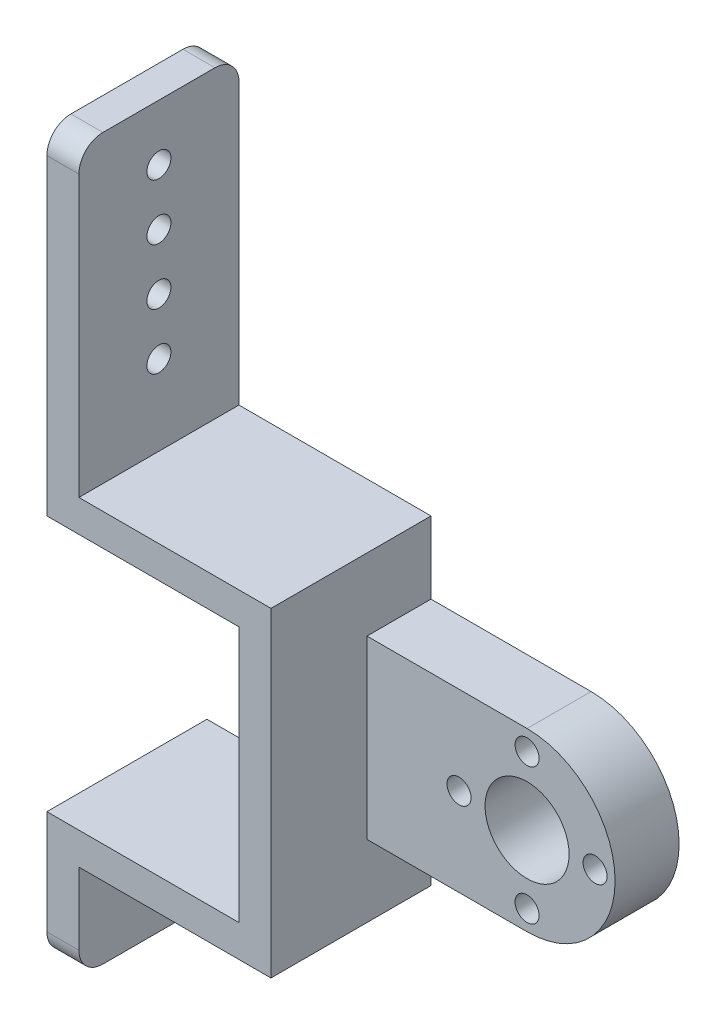
ISO-10303-21;
HEADER;
FILE_DESCRIPTION(('STEP AP214'),'2;1');
FILE_NAME('part.step','',(''),(''),'','','');
FILE_SCHEMA(('AUTOMOTIVE_DESIGN { 1 0 10303 214 1 1 1 1 }'));
ENDSEC;
DATA;
#1=APPLICATION_CONTEXT('core data for automotive mechanical design processes');
#2=APPLICATION_PROTOCOL_DEFINITION('international standard','automotive_design',2000,#1);
#3=PRODUCT_CONTEXT('',#1,'mechanical');
#4=PRODUCT('Part','Part','',(#3));
#5=PRODUCT_RELATED_PRODUCT_CATEGORY('part','',(#4));
#6=PRODUCT_DEFINITION_FORMATION('','',#4);
#7=PRODUCT_DEFINITION_CONTEXT('part definition',#1,'design');
#8=PRODUCT_DEFINITION('design','',#6,#7);
#9=PRODUCT_DEFINITION_SHAPE('','',#8);
#10=(LENGTH_UNIT() NAMED_UNIT(*) SI_UNIT(.MILLI.,.METRE.));
#11=(NAMED_UNIT(*) PLANE_ANGLE_UNIT() SI_UNIT($,.RADIAN.));
#12=(NAMED_UNIT(*) SI_UNIT($,.STERADIAN.) SOLID_ANGLE_UNIT());
#13=UNCERTAINTY_MEASURE_WITH_UNIT(LENGTH_MEASURE(1.E-05),#10,'distance_accuracy_value','');
#14=(GEOMETRIC_REPRESENTATION_CONTEXT(3) GLOBAL_UNCERTAINTY_ASSIGNED_CONTEXT((#13)) GLOBAL_UNIT_ASSIGNED_CONTEXT((#10,
#11,#12)) REPRESENTATION_CONTEXT('',''));
#15=CARTESIAN_POINT('',(0.,0.,0.));
#16=DIRECTION('',(0.,0.,1.));
#17=DIRECTION('',(1.,0.,0.));
#18=AXIS2_PLACEMENT_3D('',#15,#16,#17);
#19=CARTESIAN_POINT('',(-8.,20.,0.));
#20=DIRECTION('',(1.,0.,0.));
#21=DIRECTION('',(0.,0.,-1.));
#22=AXIS2_PLACEMENT_3D('',#19,#20,#21);
#23=PLANE('',#22);
#24=DIRECTION('',(0.,1.,0.));
#25=VECTOR('',#24,1.);
#26=CARTESIAN_POINT('',(-8.,20.,8.));
#27=LINE('',#26,#25);
#28=CARTESIAN_POINT('',(-7.99999999999999,-20.,8.));
#29=VERTEX_POINT('',#28);
#30=CARTESIAN_POINT('',(-8.,20.,8.));
#31=VERTEX_POINT('',#30);
#32=EDGE_CURVE('E357',#29,#31,#27,.T.);
#33=ORIENTED_EDGE('',*,*,#32,.F.);
#34=DIRECTION('',(0.,0.,1.));
#35=VECTOR('',#34,1.);
#36=CARTESIAN_POINT('',(-7.99999999999999,-20.,0.));
#37=LINE('',#36,#35);
#38=CARTESIAN_POINT('',(-8.,-20.,-12.));
#39=VERTEX_POINT('',#38);
#40=EDGE_CURVE('E349',#39,#29,#37,.T.);
#41=ORIENTED_EDGE('',*,*,#40,.F.);
#42=DIRECTION('',(0.,-1.,0.));
#43=VECTOR('',#42,1.);
#44=CARTESIAN_POINT('',(-8.,20.,-12.));
#45=LINE('',#44,#43);
#46=CARTESIAN_POINT('',(-8.,-11.,-12.));
#47=VERTEX_POINT('',#46);
#48=EDGE_CURVE('E336',#47,#39,#45,.T.);
#49=ORIENTED_EDGE('',*,*,#48,.F.);
#50=DIRECTION('',(0.,0.,-1.));
#51=VECTOR('',#50,1.);
#52=CARTESIAN_POINT('',(-8.,-11.,-12.));
#53=LINE('',#52,#51);
#54=CARTESIAN_POINT('',(-8.,-11.,-4.));
#55=VERTEX_POINT('',#54);
#56=EDGE_CURVE('E204',#55,#47,#53,.T.);
#57=ORIENTED_EDGE('',*,*,#56,.F.);
#58=DIRECTION('',(0.,-1.,0.));
#59=VECTOR('',#58,1.);
#60=CARTESIAN_POINT('',(-8.,11.,-4.));
#61=LINE('',#60,#59);
#62=CARTESIAN_POINT('',(-8.,11.,-4.));
#63=VERTEX_POINT('',#62);
#64=EDGE_CURVE('E224',#63,#55,#61,.T.);
#65=ORIENTED_EDGE('',*,*,#64,.F.);
#66=DIRECTION('',(0.,0.,1.));
#67=VECTOR('',#66,1.);
#68=CARTESIAN_POINT('',(-8.,11.,-12.));
#69=LINE('',#68,#67);
#70=CARTESIAN_POINT('',(-8.,11.,-12.));
#71=VERTEX_POINT('',#70);
#72=EDGE_CURVE('E214',#71,#63,#69,.T.);
#73=ORIENTED_EDGE('',*,*,#72,.F.);
#74=CARTESIAN_POINT('',(-8.,20.,-12.));
#75=VERTEX_POINT('',#74);
#76=EDGE_CURVE('E188',#75,#71,#45,.T.);
#77=ORIENTED_EDGE('',*,*,#76,.F.);
#78=DIRECTION('',(0.,0.,1.));
#79=VECTOR('',#78,1.);
#80=CARTESIAN_POINT('',(-8.,20.,0.));
#81=LINE('',#80,#79);
#82=EDGE_CURVE('E365',#75,#31,#81,.T.);
#83=ORIENTED_EDGE('',*,*,#82,.T.);
#84=EDGE_LOOP('',(#33,#41,#49,#57,#65,#73,#77,#83));
#85=FACE_BOUND('',#84,.T.);
#86=ADVANCED_FACE('F43',(#85),#23,.T.);
#87=CARTESIAN_POINT('',(-12.,0.,8.));
#88=DIRECTION('',(-1.,0.,0.));
#89=DIRECTION('',(0.,0.,1.));
#90=AXIS2_PLACEMENT_3D('',#87,#88,#89);
#91=PLANE('',#90);
#92=DIRECTION('',(0.,1.,0.));
#93=VECTOR('',#92,1.);
#94=CARTESIAN_POINT('',(-12.,20.,-12.));
#95=LINE('',#94,#93);
#96=CARTESIAN_POINT('',(-12.,-16.,-12.));
#97=VERTEX_POINT('',#96);
#98=CARTESIAN_POINT('',(-12.,16.,-12.));
#99=VERTEX_POINT('',#98);
#100=EDGE_CURVE('E343',#97,#99,#95,.T.);
#101=ORIENTED_EDGE('',*,*,#100,.F.);
#102=DIRECTION('',(0.,0.,-1.));
#103=VECTOR('',#102,1.);
#104=CARTESIAN_POINT('',(-12.,-16.,-12.));
#105=LINE('',#104,#103);
#106=CARTESIAN_POINT('',(-12.,-16.,8.));
#107=VERTEX_POINT('',#106);
#108=EDGE_CURVE('E287',#107,#97,#105,.T.);
#109=ORIENTED_EDGE('',*,*,#108,.F.);
#110=DIRECTION('',(0.,1.,0.));
#111=VECTOR('',#110,1.);
#112=CARTESIAN_POINT('',(-12.,0.,8.));
#113=LINE('',#112,#111);
#114=CARTESIAN_POINT('',(-12.,16.,8.));
#115=VERTEX_POINT('',#114);
#116=EDGE_CURVE('E368',#107,#115,#113,.T.);
#117=ORIENTED_EDGE('',*,*,#116,.T.);
#118=DIRECTION('',(0.,0.,1.));
#119=VECTOR('',#118,1.);
#120=CARTESIAN_POINT('',(-12.,16.,-12.));
#121=LINE('',#120,#119);
#122=EDGE_CURVE('E314',#99,#115,#121,.T.);
#123=ORIENTED_EDGE('',*,*,#122,.F.);
#124=EDGE_LOOP('',(#101,#109,#117,#123));
#125=FACE_BOUND('',#124,.T.);
#126=ADVANCED_FACE('F472',(#125),#91,.T.);
#127=CARTESIAN_POINT('',(0.,0.,8.));
#128=DIRECTION('',(0.,0.,1.));
#129=DIRECTION('',(1.,0.,0.));
#130=AXIS2_PLACEMENT_3D('',#127,#128,#129);
#131=PLANE('',#130);
#132=DIRECTION('',(1.,0.,0.));
#133=VECTOR('',#132,1.);
#134=CARTESIAN_POINT('',(-12.,-20.,8.));
#135=LINE('',#134,#133);
#136=CARTESIAN_POINT('',(-32.,-20.,8.));
#137=VERTEX_POINT('',#136);
#138=EDGE_CURVE('E353',#137,#29,#135,.T.);
#139=ORIENTED_EDGE('',*,*,#138,.T.);
#140=ORIENTED_EDGE('',*,*,#32,.T.);
#141=DIRECTION('',(-1.,0.,0.));
#142=VECTOR('',#141,1.);
#143=CARTESIAN_POINT('',(-12.,20.,8.));
#144=LINE('',#143,#142);
#145=CARTESIAN_POINT('',(-32.,20.,8.));
#146=VERTEX_POINT('',#145);
#147=EDGE_CURVE('E361',#31,#146,#144,.T.);
#148=ORIENTED_EDGE('',*,*,#147,.T.);
#149=DIRECTION('',(0.,-1.,0.));
#150=VECTOR('',#149,1.);
#151=CARTESIAN_POINT('',(-32.,20.,8.));
#152=LINE('',#151,#150);
#153=CARTESIAN_POINT('',(-32.,55.,8.));
#154=VERTEX_POINT('',#153);
#155=EDGE_CURVE('E277',#154,#146,#152,.T.);
#156=ORIENTED_EDGE('',*,*,#155,.F.);
#157=DIRECTION('',(1.,0.,0.));
#158=VECTOR('',#157,1.);
#159=CARTESIAN_POINT('',(0.,55.,8.));
#160=LINE('',#159,#158);
#161=CARTESIAN_POINT('',(-36.,55.,8.));
#162=VERTEX_POINT('',#161);
#163=EDGE_CURVE('E404',#154,#162,#160,.F.);
#164=ORIENTED_EDGE('',*,*,#163,.T.);
#165=DIRECTION('',(0.,1.,0.));
#166=VECTOR('',#165,1.);
#167=CARTESIAN_POINT('',(-36.,20.,8.));
#168=LINE('',#167,#166);
#169=CARTESIAN_POINT('',(-36.,16.,8.));
#170=VERTEX_POINT('',#169);
#171=EDGE_CURVE('E321',#170,#162,#168,.T.);
#172=ORIENTED_EDGE('',*,*,#171,.F.);
#173=DIRECTION('',(1.,0.,0.));
#174=VECTOR('',#173,1.);
#175=CARTESIAN_POINT('',(-36.,16.,8.));
#176=LINE('',#175,#174);
#177=EDGE_CURVE('E325',#170,#115,#176,.T.);
#178=ORIENTED_EDGE('',*,*,#177,.T.);
#179=ORIENTED_EDGE('',*,*,#116,.F.);
#180=DIRECTION('',(1.,0.,0.));
#181=VECTOR('',#180,1.);
#182=CARTESIAN_POINT('',(-36.,-16.,8.));
#183=LINE('',#182,#181);
#184=CARTESIAN_POINT('',(-36.,-16.,8.));
#185=VERTEX_POINT('',#184);
#186=EDGE_CURVE('E311',#185,#107,#183,.T.);
#187=ORIENTED_EDGE('',*,*,#186,.F.);
#188=DIRECTION('',(0.,1.,0.));
#189=VECTOR('',#188,1.);
#190=CARTESIAN_POINT('',(-36.,-20.,8.));
#191=LINE('',#190,#189);
#192=CARTESIAN_POINT('',(-36.,-29.,8.));
#193=VERTEX_POINT('',#192);
#194=EDGE_CURVE('E299',#193,#185,#191,.T.);
#195=ORIENTED_EDGE('',*,*,#194,.F.);
#196=DIRECTION('',(-1.,0.,0.));
#197=VECTOR('',#196,1.);
#198=CARTESIAN_POINT('',(0.,-29.,8.));
#199=LINE('',#198,#197);
#200=CARTESIAN_POINT('',(-32.,-29.,8.));
#201=VERTEX_POINT('',#200);
#202=EDGE_CURVE('E401',#193,#201,#199,.F.);
#203=ORIENTED_EDGE('',*,*,#202,.T.);
#204=DIRECTION('',(0.,1.,0.));
#205=VECTOR('',#204,1.);
#206=CARTESIAN_POINT('',(-32.,-32.,8.));
#207=LINE('',#206,#205);
#208=EDGE_CURVE('E267',#201,#137,#207,.T.);
#209=ORIENTED_EDGE('',*,*,#208,.T.);
#210=EDGE_LOOP('',(#139,#140,#148,#156,#164,#172,#178,#179,#187,#195,#203,#209));
#211=FACE_BOUND('',#210,.T.);
#212=ADVANCED_FACE('F480',(#211),#131,.T.);
#213=CARTESIAN_POINT('',(-12.,20.,0.));
#214=DIRECTION('',(0.,1.,0.));
#215=DIRECTION('',(0.,0.,1.));
#216=AXIS2_PLACEMENT_3D('',#213,#214,#215);
#217=PLANE('',#216);
#218=DIRECTION('',(0.,0.,-1.));
#219=VECTOR('',#218,1.);
#220=CARTESIAN_POINT('',(-32.,20.,8.));
#221=LINE('',#220,#219);
#222=CARTESIAN_POINT('',(-32.,20.,-12.));
#223=VERTEX_POINT('',#222);
#224=EDGE_CURVE('E288',#146,#223,#221,.T.);
#225=ORIENTED_EDGE('',*,*,#224,.F.);
#226=ORIENTED_EDGE('',*,*,#147,.F.);
#227=ORIENTED_EDGE('',*,*,#82,.F.);
#228=DIRECTION('',(1.,0.,0.));
#229=VECTOR('',#228,1.);
#230=CARTESIAN_POINT('',(-8.,20.,-12.));
#231=LINE('',#230,#229);
#232=EDGE_CURVE('E346',#223,#75,#231,.T.);
#233=ORIENTED_EDGE('',*,*,#232,.F.);
#234=EDGE_LOOP('',(#225,#226,#227,#233));
#235=FACE_BOUND('',#234,.T.);
#236=ADVANCED_FACE('F485',(#235),#217,.T.);
#237=CARTESIAN_POINT('',(-12.,-20.,0.));
#238=DIRECTION('',(0.,-1.,0.));
#239=DIRECTION('',(0.,0.,-1.));
#240=AXIS2_PLACEMENT_3D('',#237,#238,#239);
#241=PLANE('',#240);
#242=DIRECTION('',(0.,0.,1.));
#243=VECTOR('',#242,1.);
#244=CARTESIAN_POINT('',(-32.,-20.,8.));
#245=LINE('',#244,#243);
#246=CARTESIAN_POINT('',(-32.,-20.,-12.));
#247=VERTEX_POINT('',#246);
#248=EDGE_CURVE('E264',#247,#137,#245,.T.);
#249=ORIENTED_EDGE('',*,*,#248,.F.);
#250=DIRECTION('',(-1.,0.,0.));
#251=VECTOR('',#250,1.);
#252=CARTESIAN_POINT('',(-8.,-20.,-12.));
#253=LINE('',#252,#251);
#254=EDGE_CURVE('E339',#39,#247,#253,.T.);
#255=ORIENTED_EDGE('',*,*,#254,.F.);
#256=ORIENTED_EDGE('',*,*,#40,.T.);
#257=ORIENTED_EDGE('',*,*,#138,.F.);
#258=EDGE_LOOP('',(#249,#255,#256,#257));
#259=FACE_BOUND('',#258,.T.);
#260=ADVANCED_FACE('F530',(#259),#241,.T.);
#261=CARTESIAN_POINT('',(0.,0.,-12.));
#262=DIRECTION('',(0.,0.,-1.));
#263=DIRECTION('',(-1.,0.,0.));
#264=AXIS2_PLACEMENT_3D('',#261,#262,#263);
#265=PLANE('',#264);
#266=CARTESIAN_POINT('',(12.,8.5,-12.));
#267=DIRECTION('',(0.,0.,1.));
#268=DIRECTION('',(1.,0.,0.));
#269=AXIS2_PLACEMENT_3D('',#266,#267,#268);
#270=CIRCLE('',#269,1.5);
#271=CARTESIAN_POINT('',(13.5,8.5,-12.));
#272=VERTEX_POINT('',#271);
#273=EDGE_CURVE('E440',#272,#272,#270,.T.);
#274=ORIENTED_EDGE('',*,*,#273,.T.);
#275=EDGE_LOOP('',(#274));
#276=FACE_BOUND('',#275,.T.);
#277=CARTESIAN_POINT('',(12.,0.,-12.));
#278=DIRECTION('',(0.,0.,1.));
#279=DIRECTION('',(1.,0.,0.));
#280=AXIS2_PLACEMENT_3D('',#277,#278,#279);
#281=CIRCLE('',#280,5.25);
#282=CARTESIAN_POINT('',(17.25,0.,-12.));
#283=VERTEX_POINT('',#282);
#284=EDGE_CURVE('E972',#283,#283,#281,.T.);
#285=ORIENTED_EDGE('',*,*,#284,.T.);
#286=EDGE_LOOP('',(#285));
#287=FACE_BOUND('',#286,.T.);
#288=CARTESIAN_POINT('',(12.,-8.5,-12.));
#289=DIRECTION('',(0.,0.,1.));
#290=DIRECTION('',(1.,0.,0.));
#291=AXIS2_PLACEMENT_3D('',#288,#289,#290);
#292=CIRCLE('',#291,1.5);
#293=CARTESIAN_POINT('',(13.5,-8.5,-12.));
#294=VERTEX_POINT('',#293);
#295=EDGE_CURVE('E966',#294,#294,#292,.T.);
#296=ORIENTED_EDGE('',*,*,#295,.T.);
#297=EDGE_LOOP('',(#296));
#298=FACE_BOUND('',#297,.T.);
#299=CARTESIAN_POINT('',(3.5,0.,-12.));
#300=DIRECTION('',(0.,0.,1.));
#301=DIRECTION('',(1.,0.,0.));
#302=AXIS2_PLACEMENT_3D('',#299,#300,#301);
#303=CIRCLE('',#302,1.5);
#304=CARTESIAN_POINT('',(5.,0.,-12.));
#305=VERTEX_POINT('',#304);
#306=EDGE_CURVE('E953',#305,#305,#303,.T.);
#307=ORIENTED_EDGE('',*,*,#306,.T.);
#308=EDGE_LOOP('',(#307));
#309=FACE_BOUND('',#308,.T.);
#310=CARTESIAN_POINT('',(20.5,0.,-12.));
#311=DIRECTION('',(0.,0.,1.));
#312=DIRECTION('',(1.,0.,0.));
#313=AXIS2_PLACEMENT_3D('',#310,#311,#312);
#314=CIRCLE('',#313,1.5);
#315=CARTESIAN_POINT('',(22.,0.,-12.));
#316=VERTEX_POINT('',#315);
#317=EDGE_CURVE('E965',#316,#316,#314,.T.);
#318=ORIENTED_EDGE('',*,*,#317,.T.);
#319=EDGE_LOOP('',(#318));
#320=FACE_BOUND('',#319,.T.);
#321=DIRECTION('',(-1.,0.,0.));
#322=VECTOR('',#321,1.);
#323=CARTESIAN_POINT('',(12.,11.,-12.));
#324=LINE('',#323,#322);
#325=CARTESIAN_POINT('',(12.,11.,-12.));
#326=VERTEX_POINT('',#325);
#327=EDGE_CURVE('E182',#326,#71,#324,.T.);
#328=ORIENTED_EDGE('',*,*,#327,.F.);
#329=CARTESIAN_POINT('',(12.,0.,-12.));
#330=DIRECTION('',(0.,0.,-1.));
#331=DIRECTION('',(-1.,0.,0.));
#332=AXIS2_PLACEMENT_3D('',#329,#330,#331);
#333=CIRCLE('',#332,11.);
#334=CARTESIAN_POINT('',(12.,-11.,-12.));
#335=VERTEX_POINT('',#334);
#336=EDGE_CURVE('E186',#326,#335,#333,.T.);
#337=ORIENTED_EDGE('',*,*,#336,.T.);
#338=DIRECTION('',(-1.,0.,0.));
#339=VECTOR('',#338,1.);
#340=CARTESIAN_POINT('',(12.,-11.,-12.));
#341=LINE('',#340,#339);
#342=EDGE_CURVE('E61',#335,#47,#341,.T.);
#343=ORIENTED_EDGE('',*,*,#342,.T.);
#344=ORIENTED_EDGE('',*,*,#48,.T.);
#345=ORIENTED_EDGE('',*,*,#254,.T.);
#346=DIRECTION('',(0.,1.,0.));
#347=VECTOR('',#346,1.);
#348=CARTESIAN_POINT('',(-32.,-32.,-12.));
#349=LINE('',#348,#347);
#350=CARTESIAN_POINT('',(-32.,-29.,-12.));
#351=VERTEX_POINT('',#350);
#352=EDGE_CURVE('E273',#351,#247,#349,.T.);
#353=ORIENTED_EDGE('',*,*,#352,.F.);
#354=DIRECTION('',(1.,0.,0.));
#355=VECTOR('',#354,1.);
#356=CARTESIAN_POINT('',(0.,-29.,-12.));
#357=LINE('',#356,#355);
#358=CARTESIAN_POINT('',(-36.,-29.,-12.));
#359=VERTEX_POINT('',#358);
#360=EDGE_CURVE('E413',#351,#359,#357,.F.);
#361=ORIENTED_EDGE('',*,*,#360,.T.);
#362=DIRECTION('',(0.,-1.,0.));
#363=VECTOR('',#362,1.);
#364=CARTESIAN_POINT('',(-36.,-20.,-12.));
#365=LINE('',#364,#363);
#366=CARTESIAN_POINT('',(-36.,-16.,-12.));
#367=VERTEX_POINT('',#366);
#368=EDGE_CURVE('E295',#367,#359,#365,.T.);
#369=ORIENTED_EDGE('',*,*,#368,.F.);
#370=DIRECTION('',(1.,0.,0.));
#371=VECTOR('',#370,1.);
#372=CARTESIAN_POINT('',(-36.,-16.,-12.));
#373=LINE('',#372,#371);
#374=EDGE_CURVE('E305',#367,#97,#373,.T.);
#375=ORIENTED_EDGE('',*,*,#374,.T.);
#376=ORIENTED_EDGE('',*,*,#100,.T.);
#377=DIRECTION('',(1.,0.,0.));
#378=VECTOR('',#377,1.);
#379=CARTESIAN_POINT('',(-36.,16.,-12.));
#380=LINE('',#379,#378);
#381=CARTESIAN_POINT('',(-36.,16.,-12.));
#382=VERTEX_POINT('',#381);
#383=EDGE_CURVE('E332',#382,#99,#380,.T.);
#384=ORIENTED_EDGE('',*,*,#383,.F.);
#385=DIRECTION('',(0.,-1.,0.));
#386=VECTOR('',#385,1.);
#387=CARTESIAN_POINT('',(-36.,20.,-12.));
#388=LINE('',#387,#386);
#389=CARTESIAN_POINT('',(-36.,55.,-12.));
#390=VERTEX_POINT('',#389);
#391=EDGE_CURVE('E315',#390,#382,#388,.T.);
#392=ORIENTED_EDGE('',*,*,#391,.F.);
#393=DIRECTION('',(1.,0.,0.));
#394=VECTOR('',#393,1.);
#395=CARTESIAN_POINT('',(0.,55.,-12.));
#396=LINE('',#395,#394);
#397=CARTESIAN_POINT('',(-32.,55.,-12.));
#398=VERTEX_POINT('',#397);
#399=EDGE_CURVE('E416',#390,#398,#396,.T.);
#400=ORIENTED_EDGE('',*,*,#399,.T.);
#401=DIRECTION('',(0.,-1.,0.));
#402=VECTOR('',#401,1.);
#403=CARTESIAN_POINT('',(-32.,20.,-12.));
#404=LINE('',#403,#402);
#405=EDGE_CURVE('E276',#398,#223,#404,.T.);
#406=ORIENTED_EDGE('',*,*,#405,.T.);
#407=ORIENTED_EDGE('',*,*,#232,.T.);
#408=ORIENTED_EDGE('',*,*,#76,.T.);
#409=EDGE_LOOP('',(#328,#337,#343,#344,#345,#353,#361,#369,#375,#376,#384,#392,#400,#406,#407,#408));
#410=FACE_BOUND('',#409,.T.);
#411=ADVANCED_FACE('F184',(#276,#287,#298,#309,#320,#410),#265,.T.);
#412=CARTESIAN_POINT('',(-36.,16.,-12.));
#413=DIRECTION('',(0.,1.,0.));
#414=DIRECTION('',(0.,0.,1.));
#415=AXIS2_PLACEMENT_3D('',#412,#413,#414);
#416=PLANE('',#415);
#417=ORIENTED_EDGE('',*,*,#122,.T.);
#418=ORIENTED_EDGE('',*,*,#177,.F.);
#419=DIRECTION('',(0.,0.,1.));
#420=VECTOR('',#419,1.);
#421=CARTESIAN_POINT('',(-36.,16.,-12.));
#422=LINE('',#421,#420);
#423=EDGE_CURVE('E318',#382,#170,#422,.T.);
#424=ORIENTED_EDGE('',*,*,#423,.F.);
#425=ORIENTED_EDGE('',*,*,#383,.T.);
#426=EDGE_LOOP('',(#417,#418,#424,#425));
#427=FACE_BOUND('',#426,.T.);
#428=ADVANCED_FACE('F560',(#427),#416,.F.);
#429=CARTESIAN_POINT('',(-36.,0.,0.));
#430=DIRECTION('',(-1.,0.,0.));
#431=DIRECTION('',(0.,0.,1.));
#432=AXIS2_PLACEMENT_3D('',#429,#430,#431);
#433=PLANE('',#432);
#434=CARTESIAN_POINT('',(-36.,51.,-2.));
#435=DIRECTION('',(-1.,0.,0.));
#436=DIRECTION('',(0.,0.,1.));
#437=AXIS2_PLACEMENT_3D('',#434,#435,#436);
#438=CIRCLE('',#437,1.5);
#439=CARTESIAN_POINT('',(-36.,51.,-0.499999999999999));
#440=VERTEX_POINT('',#439);
#441=EDGE_CURVE('E237',#440,#440,#438,.T.);
#442=ORIENTED_EDGE('',*,*,#441,.F.);
#443=EDGE_LOOP('',(#442));
#444=FACE_BOUND('',#443,.T.);
#445=CARTESIAN_POINT('',(-36.,44.,-2.));
#446=DIRECTION('',(-1.,0.,0.));
#447=DIRECTION('',(0.,0.,1.));
#448=AXIS2_PLACEMENT_3D('',#445,#446,#447);
#449=CIRCLE('',#448,1.5);
#450=CARTESIAN_POINT('',(-36.,44.,-0.499999999999999));
#451=VERTEX_POINT('',#450);
#452=EDGE_CURVE('E242',#451,#451,#449,.T.);
#453=ORIENTED_EDGE('',*,*,#452,.F.);
#454=EDGE_LOOP('',(#453));
#455=FACE_BOUND('',#454,.T.);
#456=CARTESIAN_POINT('',(-36.,37.,-2.));
#457=DIRECTION('',(-1.,0.,0.));
#458=DIRECTION('',(0.,0.,1.));
#459=AXIS2_PLACEMENT_3D('',#456,#457,#458);
#460=CIRCLE('',#459,1.5);
#461=CARTESIAN_POINT('',(-36.,37.,-0.499999999999999));
#462=VERTEX_POINT('',#461);
#463=EDGE_CURVE('E246',#462,#462,#460,.T.);
#464=ORIENTED_EDGE('',*,*,#463,.F.);
#465=EDGE_LOOP('',(#464));
#466=FACE_BOUND('',#465,.T.);
#467=CARTESIAN_POINT('',(-36.,30.,-2.));
#468=DIRECTION('',(-1.,0.,0.));
#469=DIRECTION('',(0.,0.,1.));
#470=AXIS2_PLACEMENT_3D('',#467,#468,#469);
#471=CIRCLE('',#470,1.5);
#472=CARTESIAN_POINT('',(-36.,30.,-0.499999999999999));
#473=VERTEX_POINT('',#472);
#474=EDGE_CURVE('E192',#473,#473,#471,.T.);
#475=ORIENTED_EDGE('',*,*,#474,.F.);
#476=EDGE_LOOP('',(#475));
#477=FACE_BOUND('',#476,.T.);
#478=ORIENTED_EDGE('',*,*,#171,.T.);
#479=CARTESIAN_POINT('',(-36.,55.,5.));
#480=DIRECTION('',(-1.,0.,0.));
#481=DIRECTION('',(0.,0.,1.));
#482=AXIS2_PLACEMENT_3D('',#479,#480,#481);
#483=CIRCLE('',#482,3.);
#484=CARTESIAN_POINT('',(-36.,58.,5.));
#485=VERTEX_POINT('',#484);
#486=EDGE_CURVE('E410',#162,#485,#483,.T.);
#487=ORIENTED_EDGE('',*,*,#486,.T.);
#488=DIRECTION('',(0.,0.,-1.));
#489=VECTOR('',#488,1.);
#490=CARTESIAN_POINT('',(-36.,58.,8.));
#491=LINE('',#490,#489);
#492=CARTESIAN_POINT('',(-36.,58.,-9.));
#493=VERTEX_POINT('',#492);
#494=EDGE_CURVE('E283',#485,#493,#491,.T.);
#495=ORIENTED_EDGE('',*,*,#494,.T.);
#496=CARTESIAN_POINT('',(-36.,55.,-9.));
#497=DIRECTION('',(-1.,0.,0.));
#498=DIRECTION('',(0.,0.,1.));
#499=AXIS2_PLACEMENT_3D('',#496,#497,#498);
#500=CIRCLE('',#499,3.);
#501=EDGE_CURVE('E407',#493,#390,#500,.T.);
#502=ORIENTED_EDGE('',*,*,#501,.T.);
#503=ORIENTED_EDGE('',*,*,#391,.T.);
#504=ORIENTED_EDGE('',*,*,#423,.T.);
#505=EDGE_LOOP('',(#478,#487,#495,#502,#503,#504));
#506=FACE_BOUND('',#505,.T.);
#507=ADVANCED_FACE('F549',(#444,#455,#466,#477,#506),#433,.T.);
#508=CARTESIAN_POINT('',(-36.,-16.,-12.));
#509=DIRECTION('',(0.,-1.,0.));
#510=DIRECTION('',(0.,0.,-1.));
#511=AXIS2_PLACEMENT_3D('',#508,#509,#510);
#512=PLANE('',#511);
#513=ORIENTED_EDGE('',*,*,#108,.T.);
#514=ORIENTED_EDGE('',*,*,#374,.F.);
#515=DIRECTION('',(0.,0.,-1.));
#516=VECTOR('',#515,1.);
#517=CARTESIAN_POINT('',(-36.,-16.,-12.));
#518=LINE('',#517,#516);
#519=EDGE_CURVE('E302',#185,#367,#518,.T.);
#520=ORIENTED_EDGE('',*,*,#519,.F.);
#521=ORIENTED_EDGE('',*,*,#186,.T.);
#522=EDGE_LOOP('',(#513,#514,#520,#521));
#523=FACE_BOUND('',#522,.T.);
#524=ADVANCED_FACE('F522',(#523),#512,.F.);
#525=CARTESIAN_POINT('',(-36.,0.,0.));
#526=DIRECTION('',(1.,0.,0.));
#527=DIRECTION('',(0.,0.,-1.));
#528=AXIS2_PLACEMENT_3D('',#525,#526,#527);
#529=PLANE('',#528);
#530=CARTESIAN_POINT('',(-36.,-27.5,-2.));
#531=DIRECTION('',(-1.,0.,0.));
#532=DIRECTION('',(0.,0.,1.));
#533=AXIS2_PLACEMENT_3D('',#530,#531,#532);
#534=CIRCLE('',#533,1.5);
#535=CARTESIAN_POINT('',(-36.,-27.5,-0.499999999999999));
#536=VERTEX_POINT('',#535);
#537=EDGE_CURVE('E253',#536,#536,#534,.T.);
#538=ORIENTED_EDGE('',*,*,#537,.F.);
#539=EDGE_LOOP('',(#538));
#540=FACE_BOUND('',#539,.T.);
#541=ORIENTED_EDGE('',*,*,#368,.T.);
#542=CARTESIAN_POINT('',(-36.,-29.,-9.));
#543=DIRECTION('',(1.,0.,0.));
#544=DIRECTION('',(0.,0.,-1.));
#545=AXIS2_PLACEMENT_3D('',#542,#543,#544);
#546=CIRCLE('',#545,3.);
#547=CARTESIAN_POINT('',(-36.,-32.,-9.));
#548=VERTEX_POINT('',#547);
#549=EDGE_CURVE('E11',#359,#548,#546,.F.);
#550=ORIENTED_EDGE('',*,*,#549,.T.);
#551=DIRECTION('',(0.,0.,-1.));
#552=VECTOR('',#551,1.);
#553=CARTESIAN_POINT('',(-36.,-32.,8.));
#554=LINE('',#553,#552);
#555=CARTESIAN_POINT('',(-36.,-32.,5.));
#556=VERTEX_POINT('',#555);
#557=EDGE_CURVE('E259',#556,#548,#554,.T.);
#558=ORIENTED_EDGE('',*,*,#557,.F.);
#559=CARTESIAN_POINT('',(-36.,-29.,5.));
#560=DIRECTION('',(1.,0.,0.));
#561=DIRECTION('',(0.,0.,-1.));
#562=AXIS2_PLACEMENT_3D('',#559,#560,#561);
#563=CIRCLE('',#562,3.);
#564=EDGE_CURVE('E53',#556,#193,#563,.F.);
#565=ORIENTED_EDGE('',*,*,#564,.T.);
#566=ORIENTED_EDGE('',*,*,#194,.T.);
#567=ORIENTED_EDGE('',*,*,#519,.T.);
#568=EDGE_LOOP('',(#541,#550,#558,#565,#566,#567));
#569=FACE_BOUND('',#568,.T.);
#570=ADVANCED_FACE('F509',(#540,#569),#529,.F.);
#571=CARTESIAN_POINT('',(-36.,58.,8.));
#572=DIRECTION('',(0.,1.,0.));
#573=DIRECTION('',(0.,0.,1.));
#574=AXIS2_PLACEMENT_3D('',#571,#572,#573);
#575=PLANE('',#574);
#576=ORIENTED_EDGE('',*,*,#494,.F.);
#577=DIRECTION('',(1.,0.,0.));
#578=VECTOR('',#577,1.);
#579=CARTESIAN_POINT('',(-36.,58.,5.));
#580=LINE('',#579,#578);
#581=CARTESIAN_POINT('',(-32.,58.,5.));
#582=VERTEX_POINT('',#581);
#583=EDGE_CURVE('E391',#485,#582,#580,.T.);
#584=ORIENTED_EDGE('',*,*,#583,.T.);
#585=DIRECTION('',(0.,0.,-1.));
#586=VECTOR('',#585,1.);
#587=CARTESIAN_POINT('',(-32.,58.,8.));
#588=LINE('',#587,#586);
#589=CARTESIAN_POINT('',(-32.,58.,-9.));
#590=VERTEX_POINT('',#589);
#591=EDGE_CURVE('E280',#582,#590,#588,.T.);
#592=ORIENTED_EDGE('',*,*,#591,.T.);
#593=DIRECTION('',(1.,0.,0.));
#594=VECTOR('',#593,1.);
#595=CARTESIAN_POINT('',(-36.,58.,-9.));
#596=LINE('',#595,#594);
#597=EDGE_CURVE('E371',#590,#493,#596,.F.);
#598=ORIENTED_EDGE('',*,*,#597,.T.);
#599=EDGE_LOOP('',(#576,#584,#592,#598));
#600=FACE_BOUND('',#599,.T.);
#601=ADVANCED_FACE('F552',(#600),#575,.T.);
#602=CARTESIAN_POINT('',(-32.,20.,8.));
#603=DIRECTION('',(1.,0.,0.));
#604=DIRECTION('',(0.,0.,-1.));
#605=AXIS2_PLACEMENT_3D('',#602,#603,#604);
#606=PLANE('',#605);
#607=CARTESIAN_POINT('',(-32.,51.,-2.));
#608=DIRECTION('',(1.,0.,0.));
#609=DIRECTION('',(0.,0.,-1.));
#610=AXIS2_PLACEMENT_3D('',#607,#608,#609);
#611=CIRCLE('',#610,1.5);
#612=CARTESIAN_POINT('',(-32.,51.,-3.5));
#613=VERTEX_POINT('',#612);
#614=EDGE_CURVE('E258',#613,#613,#611,.T.);
#615=ORIENTED_EDGE('',*,*,#614,.F.);
#616=EDGE_LOOP('',(#615));
#617=FACE_BOUND('',#616,.T.);
#618=CARTESIAN_POINT('',(-32.,44.,-2.));
#619=DIRECTION('',(1.,0.,0.));
#620=DIRECTION('',(0.,0.,-1.));
#621=AXIS2_PLACEMENT_3D('',#618,#619,#620);
#622=CIRCLE('',#621,1.5);
#623=CARTESIAN_POINT('',(-32.,44.,-3.5));
#624=VERTEX_POINT('',#623);
#625=EDGE_CURVE('E382',#624,#624,#622,.T.);
#626=ORIENTED_EDGE('',*,*,#625,.F.);
#627=EDGE_LOOP('',(#626));
#628=FACE_BOUND('',#627,.T.);
#629=CARTESIAN_POINT('',(-32.,37.,-2.));
#630=DIRECTION('',(1.,0.,0.));
#631=DIRECTION('',(0.,0.,-1.));
#632=AXIS2_PLACEMENT_3D('',#629,#630,#631);
#633=CIRCLE('',#632,1.5);
#634=CARTESIAN_POINT('',(-32.,37.,-3.5));
#635=VERTEX_POINT('',#634);
#636=EDGE_CURVE('E378',#635,#635,#633,.T.);
#637=ORIENTED_EDGE('',*,*,#636,.F.);
#638=EDGE_LOOP('',(#637));
#639=FACE_BOUND('',#638,.T.);
#640=CARTESIAN_POINT('',(-32.,30.,-2.));
#641=DIRECTION('',(1.,0.,0.));
#642=DIRECTION('',(0.,0.,-1.));
#643=AXIS2_PLACEMENT_3D('',#640,#641,#642);
#644=CIRCLE('',#643,1.5);
#645=CARTESIAN_POINT('',(-32.,30.,-3.5));
#646=VERTEX_POINT('',#645);
#647=EDGE_CURVE('E241',#646,#646,#644,.T.);
#648=ORIENTED_EDGE('',*,*,#647,.F.);
#649=EDGE_LOOP('',(#648));
#650=FACE_BOUND('',#649,.T.);
#651=ORIENTED_EDGE('',*,*,#591,.F.);
#652=CARTESIAN_POINT('',(-32.,55.,5.));
#653=DIRECTION('',(1.,0.,0.));
#654=DIRECTION('',(0.,0.,-1.));
#655=AXIS2_PLACEMENT_3D('',#652,#653,#654);
#656=CIRCLE('',#655,3.);
#657=EDGE_CURVE('E398',#582,#154,#656,.T.);
#658=ORIENTED_EDGE('',*,*,#657,.T.);
#659=ORIENTED_EDGE('',*,*,#155,.T.);
#660=ORIENTED_EDGE('',*,*,#224,.T.);
#661=ORIENTED_EDGE('',*,*,#405,.F.);
#662=CARTESIAN_POINT('',(-32.,55.,-9.));
#663=DIRECTION('',(1.,0.,0.));
#664=DIRECTION('',(0.,0.,-1.));
#665=AXIS2_PLACEMENT_3D('',#662,#663,#664);
#666=CIRCLE('',#665,3.);
#667=EDGE_CURVE('E395',#398,#590,#666,.T.);
#668=ORIENTED_EDGE('',*,*,#667,.T.);
#669=EDGE_LOOP('',(#651,#658,#659,#660,#661,#668));
#670=FACE_BOUND('',#669,.T.);
#671=ADVANCED_FACE('F542',(#617,#628,#639,#650,#670),#606,.T.);
#672=CARTESIAN_POINT('',(-32.,-32.,8.));
#673=DIRECTION('',(-1.,0.,0.));
#674=DIRECTION('',(0.,0.,1.));
#675=AXIS2_PLACEMENT_3D('',#672,#673,#674);
#676=PLANE('',#675);
#677=CARTESIAN_POINT('',(-32.,-27.5,-2.));
#678=DIRECTION('',(-1.,0.,0.));
#679=DIRECTION('',(0.,0.,1.));
#680=AXIS2_PLACEMENT_3D('',#677,#678,#679);
#681=CIRCLE('',#680,1.5);
#682=CARTESIAN_POINT('',(-32.,-27.5,-0.499999999999999));
#683=VERTEX_POINT('',#682);
#684=EDGE_CURVE('E257',#683,#683,#681,.T.);
#685=ORIENTED_EDGE('',*,*,#684,.T.);
#686=EDGE_LOOP('',(#685));
#687=FACE_BOUND('',#686,.T.);
#688=DIRECTION('',(0.,0.,1.));
#689=VECTOR('',#688,1.);
#690=CARTESIAN_POINT('',(-32.,-32.,8.));
#691=LINE('',#690,#689);
#692=CARTESIAN_POINT('',(-32.,-32.,-9.));
#693=VERTEX_POINT('',#692);
#694=CARTESIAN_POINT('',(-32.,-32.,5.));
#695=VERTEX_POINT('',#694);
#696=EDGE_CURVE('E263',#693,#695,#691,.T.);
#697=ORIENTED_EDGE('',*,*,#696,.F.);
#698=CARTESIAN_POINT('',(-32.,-29.,-9.));
#699=DIRECTION('',(-1.,0.,0.));
#700=DIRECTION('',(0.,0.,1.));
#701=AXIS2_PLACEMENT_3D('',#698,#699,#700);
#702=CIRCLE('',#701,3.);
#703=EDGE_CURVE('E430',#693,#351,#702,.F.);
#704=ORIENTED_EDGE('',*,*,#703,.T.);
#705=ORIENTED_EDGE('',*,*,#352,.T.);
#706=ORIENTED_EDGE('',*,*,#248,.T.);
#707=ORIENTED_EDGE('',*,*,#208,.F.);
#708=CARTESIAN_POINT('',(-32.,-29.,5.));
#709=DIRECTION('',(-1.,0.,0.));
#710=DIRECTION('',(0.,0.,1.));
#711=AXIS2_PLACEMENT_3D('',#708,#709,#710);
#712=CIRCLE('',#711,3.);
#713=EDGE_CURVE('E69',#201,#695,#712,.F.);
#714=ORIENTED_EDGE('',*,*,#713,.T.);
#715=EDGE_LOOP('',(#697,#704,#705,#706,#707,#714));
#716=FACE_BOUND('',#715,.T.);
#717=ADVANCED_FACE('F527',(#687,#716),#676,.F.);
#718=CARTESIAN_POINT('',(0.,-32.,0.));
#719=DIRECTION('',(0.,-1.,0.));
#720=DIRECTION('',(0.,0.,-1.));
#721=AXIS2_PLACEMENT_3D('',#718,#719,#720);
#722=PLANE('',#721);
#723=ORIENTED_EDGE('',*,*,#557,.T.);
#724=DIRECTION('',(1.,0.,0.));
#725=VECTOR('',#724,1.);
#726=CARTESIAN_POINT('',(0.,-32.,-9.));
#727=LINE('',#726,#725);
#728=EDGE_CURVE('E424',#548,#693,#727,.T.);
#729=ORIENTED_EDGE('',*,*,#728,.T.);
#730=ORIENTED_EDGE('',*,*,#696,.T.);
#731=DIRECTION('',(-1.,0.,0.));
#732=VECTOR('',#731,1.);
#733=CARTESIAN_POINT('',(0.,-32.,5.));
#734=LINE('',#733,#732);
#735=EDGE_CURVE('E420',#695,#556,#734,.T.);
#736=ORIENTED_EDGE('',*,*,#735,.T.);
#737=EDGE_LOOP('',(#723,#729,#730,#736));
#738=FACE_BOUND('',#737,.T.);
#739=ADVANCED_FACE('F512',(#738),#722,.T.);
#740=CARTESIAN_POINT('',(-24.,-27.5,-2.));
#741=DIRECTION('',(-1.,0.,0.));
#742=DIRECTION('',(0.,0.,1.));
#743=AXIS2_PLACEMENT_3D('',#740,#741,#742);
#744=CYLINDRICAL_SURFACE('',#743,1.5);
#745=ORIENTED_EDGE('',*,*,#537,.T.);
#746=EDGE_LOOP('',(#745));
#747=FACE_BOUND('',#746,.T.);
#748=ORIENTED_EDGE('',*,*,#684,.F.);
#749=EDGE_LOOP('',(#748));
#750=FACE_BOUND('',#749,.T.);
#751=ADVANCED_FACE('F640',(#747,#750),#744,.F.);
#752=CARTESIAN_POINT('',(-24.,30.,-2.));
#753=DIRECTION('',(-1.,0.,0.));
#754=DIRECTION('',(0.,0.,1.));
#755=AXIS2_PLACEMENT_3D('',#752,#753,#754);
#756=CYLINDRICAL_SURFACE('',#755,1.5);
#757=ORIENTED_EDGE('',*,*,#647,.T.);
#758=EDGE_LOOP('',(#757));
#759=FACE_BOUND('',#758,.T.);
#760=ORIENTED_EDGE('',*,*,#474,.T.);
#761=EDGE_LOOP('',(#760));
#762=FACE_BOUND('',#761,.T.);
#763=ADVANCED_FACE('F648',(#759,#762),#756,.F.);
#764=CARTESIAN_POINT('',(-24.,37.,-2.));
#765=DIRECTION('',(-1.,0.,0.));
#766=DIRECTION('',(0.,0.,1.));
#767=AXIS2_PLACEMENT_3D('',#764,#765,#766);
#768=CYLINDRICAL_SURFACE('',#767,1.5);
#769=ORIENTED_EDGE('',*,*,#636,.T.);
#770=EDGE_LOOP('',(#769));
#771=FACE_BOUND('',#770,.T.);
#772=ORIENTED_EDGE('',*,*,#463,.T.);
#773=EDGE_LOOP('',(#772));
#774=FACE_BOUND('',#773,.T.);
#775=ADVANCED_FACE('F656',(#771,#774),#768,.F.);
#776=CARTESIAN_POINT('',(-24.,44.,-2.));
#777=DIRECTION('',(-1.,0.,0.));
#778=DIRECTION('',(0.,0.,1.));
#779=AXIS2_PLACEMENT_3D('',#776,#777,#778);
#780=CYLINDRICAL_SURFACE('',#779,1.5);
#781=ORIENTED_EDGE('',*,*,#625,.T.);
#782=EDGE_LOOP('',(#781));
#783=FACE_BOUND('',#782,.T.);
#784=ORIENTED_EDGE('',*,*,#452,.T.);
#785=EDGE_LOOP('',(#784));
#786=FACE_BOUND('',#785,.T.);
#787=ADVANCED_FACE('F664',(#783,#786),#780,.F.);
#788=CARTESIAN_POINT('',(-24.,51.,-2.));
#789=DIRECTION('',(-1.,0.,0.));
#790=DIRECTION('',(0.,0.,1.));
#791=AXIS2_PLACEMENT_3D('',#788,#789,#790);
#792=CYLINDRICAL_SURFACE('',#791,1.5);
#793=ORIENTED_EDGE('',*,*,#614,.T.);
#794=EDGE_LOOP('',(#793));
#795=FACE_BOUND('',#794,.T.);
#796=ORIENTED_EDGE('',*,*,#441,.T.);
#797=EDGE_LOOP('',(#796));
#798=FACE_BOUND('',#797,.T.);
#799=ADVANCED_FACE('F494',(#795,#798),#792,.F.);
#800=CARTESIAN_POINT('',(-36.,55.,5.));
#801=DIRECTION('',(1.,0.,0.));
#802=DIRECTION('',(0.,0.,-1.));
#803=AXIS2_PLACEMENT_3D('',#800,#801,#802);
#804=CYLINDRICAL_SURFACE('',#803,3.);
#805=ORIENTED_EDGE('',*,*,#486,.F.);
#806=ORIENTED_EDGE('',*,*,#163,.F.);
#807=ORIENTED_EDGE('',*,*,#657,.F.);
#808=ORIENTED_EDGE('',*,*,#583,.F.);
#809=EDGE_LOOP('',(#805,#806,#807,#808));
#810=FACE_BOUND('',#809,.T.);
#811=ADVANCED_FACE('F490',(#810),#804,.T.);
#812=CARTESIAN_POINT('',(0.,55.,-9.));
#813=DIRECTION('',(1.,0.,0.));
#814=DIRECTION('',(0.,0.,-1.));
#815=AXIS2_PLACEMENT_3D('',#812,#813,#814);
#816=CYLINDRICAL_SURFACE('',#815,3.);
#817=ORIENTED_EDGE('',*,*,#501,.F.);
#818=ORIENTED_EDGE('',*,*,#597,.F.);
#819=ORIENTED_EDGE('',*,*,#667,.F.);
#820=ORIENTED_EDGE('',*,*,#399,.F.);
#821=EDGE_LOOP('',(#817,#818,#819,#820));
#822=FACE_BOUND('',#821,.T.);
#823=ADVANCED_FACE('F493',(#822),#816,.T.);
#824=CARTESIAN_POINT('',(0.,-29.,-9.));
#825=DIRECTION('',(1.,0.,0.));
#826=DIRECTION('',(0.,0.,-1.));
#827=AXIS2_PLACEMENT_3D('',#824,#825,#826);
#828=CYLINDRICAL_SURFACE('',#827,3.);
#829=ORIENTED_EDGE('',*,*,#549,.F.);
#830=ORIENTED_EDGE('',*,*,#360,.F.);
#831=ORIENTED_EDGE('',*,*,#703,.F.);
#832=ORIENTED_EDGE('',*,*,#728,.F.);
#833=EDGE_LOOP('',(#829,#830,#831,#832));
#834=FACE_BOUND('',#833,.T.);
#835=ADVANCED_FACE('F497',(#834),#828,.T.);
#836=CARTESIAN_POINT('',(0.,-29.,5.));
#837=DIRECTION('',(-1.,0.,0.));
#838=DIRECTION('',(0.,0.,1.));
#839=AXIS2_PLACEMENT_3D('',#836,#837,#838);
#840=CYLINDRICAL_SURFACE('',#839,3.);
#841=ORIENTED_EDGE('',*,*,#713,.F.);
#842=ORIENTED_EDGE('',*,*,#202,.F.);
#843=ORIENTED_EDGE('',*,*,#564,.F.);
#844=ORIENTED_EDGE('',*,*,#735,.F.);
#845=EDGE_LOOP('',(#841,#842,#843,#844));
#846=FACE_BOUND('',#845,.T.);
#847=ADVANCED_FACE('F45',(#846),#840,.T.);
#848=CARTESIAN_POINT('',(12.,11.,-12.));
#849=DIRECTION('',(0.,-1.,0.));
#850=DIRECTION('',(0.,0.,-1.));
#851=AXIS2_PLACEMENT_3D('',#848,#849,#850);
#852=PLANE('',#851);
#853=ORIENTED_EDGE('',*,*,#72,.T.);
#854=DIRECTION('',(-1.,0.,0.));
#855=VECTOR('',#854,1.);
#856=CARTESIAN_POINT('',(12.,11.,-4.));
#857=LINE('',#856,#855);
#858=CARTESIAN_POINT('',(12.,11.,-4.));
#859=VERTEX_POINT('',#858);
#860=EDGE_CURVE('E193',#859,#63,#857,.T.);
#861=ORIENTED_EDGE('',*,*,#860,.F.);
#862=DIRECTION('',(0.,0.,1.));
#863=VECTOR('',#862,1.);
#864=CARTESIAN_POINT('',(12.,11.,-12.));
#865=LINE('',#864,#863);
#866=EDGE_CURVE('E196',#326,#859,#865,.T.);
#867=ORIENTED_EDGE('',*,*,#866,.F.);
#868=ORIENTED_EDGE('',*,*,#327,.T.);
#869=EDGE_LOOP('',(#853,#861,#867,#868));
#870=FACE_BOUND('',#869,.T.);
#871=ADVANCED_FACE('F197',(#870),#852,.F.);
#872=CARTESIAN_POINT('',(12.,11.,-4.));
#873=DIRECTION('',(0.,0.,-1.));
#874=DIRECTION('',(0.,1.,0.));
#875=AXIS2_PLACEMENT_3D('',#872,#873,#874);
#876=PLANE('',#875);
#877=CARTESIAN_POINT('',(12.,8.5,-4.));
#878=DIRECTION('',(0.,0.,-1.));
#879=DIRECTION('',(0.,1.,0.));
#880=AXIS2_PLACEMENT_3D('',#877,#878,#879);
#881=CIRCLE('',#880,1.5);
#882=CARTESIAN_POINT('',(12.,10.,-4.));
#883=VERTEX_POINT('',#882);
#884=EDGE_CURVE('E47',#883,#883,#881,.T.);
#885=ORIENTED_EDGE('',*,*,#884,.T.);
#886=EDGE_LOOP('',(#885));
#887=FACE_BOUND('',#886,.T.);
#888=CARTESIAN_POINT('',(12.,0.,-4.));
#889=DIRECTION('',(0.,0.,-1.));
#890=DIRECTION('',(0.,1.,0.));
#891=AXIS2_PLACEMENT_3D('',#888,#889,#890);
#892=CIRCLE('',#891,5.25);
#893=CARTESIAN_POINT('',(12.,5.25,-4.));
#894=VERTEX_POINT('',#893);
#895=EDGE_CURVE('E217',#894,#894,#892,.T.);
#896=ORIENTED_EDGE('',*,*,#895,.T.);
#897=EDGE_LOOP('',(#896));
#898=FACE_BOUND('',#897,.T.);
#899=CARTESIAN_POINT('',(12.,-8.5,-4.));
#900=DIRECTION('',(0.,0.,-1.));
#901=DIRECTION('',(0.,1.,0.));
#902=AXIS2_PLACEMENT_3D('',#899,#900,#901);
#903=CIRCLE('',#902,1.5);
#904=CARTESIAN_POINT('',(12.,-7.,-4.));
#905=VERTEX_POINT('',#904);
#906=EDGE_CURVE('E444',#905,#905,#903,.T.);
#907=ORIENTED_EDGE('',*,*,#906,.T.);
#908=EDGE_LOOP('',(#907));
#909=FACE_BOUND('',#908,.T.);
#910=CARTESIAN_POINT('',(3.5,0.,-4.));
#911=DIRECTION('',(0.,0.,-1.));
#912=DIRECTION('',(0.,1.,0.));
#913=AXIS2_PLACEMENT_3D('',#910,#911,#912);
#914=CIRCLE('',#913,1.5);
#915=CARTESIAN_POINT('',(3.5,1.5,-4.));
#916=VERTEX_POINT('',#915);
#917=EDGE_CURVE('E439',#916,#916,#914,.T.);
#918=ORIENTED_EDGE('',*,*,#917,.T.);
#919=EDGE_LOOP('',(#918));
#920=FACE_BOUND('',#919,.T.);
#921=CARTESIAN_POINT('',(20.5,0.,-4.));
#922=DIRECTION('',(0.,0.,-1.));
#923=DIRECTION('',(0.,1.,0.));
#924=AXIS2_PLACEMENT_3D('',#921,#922,#923);
#925=CIRCLE('',#924,1.5);
#926=CARTESIAN_POINT('',(20.5,1.5,-4.));
#927=VERTEX_POINT('',#926);
#928=EDGE_CURVE('E435',#927,#927,#925,.T.);
#929=ORIENTED_EDGE('',*,*,#928,.T.);
#930=EDGE_LOOP('',(#929));
#931=FACE_BOUND('',#930,.T.);
#932=DIRECTION('',(-1.,0.,0.));
#933=VECTOR('',#932,1.);
#934=CARTESIAN_POINT('',(12.,-11.,-4.));
#935=LINE('',#934,#933);
#936=CARTESIAN_POINT('',(12.,-11.,-4.));
#937=VERTEX_POINT('',#936);
#938=EDGE_CURVE('E231',#937,#55,#935,.T.);
#939=ORIENTED_EDGE('',*,*,#938,.F.);
#940=CARTESIAN_POINT('',(12.,0.,-4.));
#941=DIRECTION('',(0.,0.,-1.));
#942=DIRECTION('',(-1.,0.,0.));
#943=AXIS2_PLACEMENT_3D('',#940,#941,#942);
#944=CIRCLE('',#943,11.);
#945=EDGE_CURVE('E210',#859,#937,#944,.T.);
#946=ORIENTED_EDGE('',*,*,#945,.F.);
#947=ORIENTED_EDGE('',*,*,#860,.T.);
#948=ORIENTED_EDGE('',*,*,#64,.T.);
#949=EDGE_LOOP('',(#939,#946,#947,#948));
#950=FACE_BOUND('',#949,.T.);
#951=ADVANCED_FACE('F451',(#887,#898,#909,#920,#931,#950),#876,.F.);
#952=CARTESIAN_POINT('',(12.,-11.,-12.));
#953=DIRECTION('',(0.,1.,0.));
#954=DIRECTION('',(0.,0.,1.));
#955=AXIS2_PLACEMENT_3D('',#952,#953,#954);
#956=PLANE('',#955);
#957=ORIENTED_EDGE('',*,*,#56,.T.);
#958=ORIENTED_EDGE('',*,*,#342,.F.);
#959=DIRECTION('',(0.,0.,-1.));
#960=VECTOR('',#959,1.);
#961=CARTESIAN_POINT('',(12.,-11.,-12.));
#962=LINE('',#961,#960);
#963=EDGE_CURVE('E203',#937,#335,#962,.T.);
#964=ORIENTED_EDGE('',*,*,#963,.F.);
#965=ORIENTED_EDGE('',*,*,#938,.T.);
#966=EDGE_LOOP('',(#957,#958,#964,#965));
#967=FACE_BOUND('',#966,.T.);
#968=ADVANCED_FACE('F718',(#967),#956,.F.);
#969=CARTESIAN_POINT('',(12.,0.,-4.));
#970=DIRECTION('',(0.,0.,-1.));
#971=DIRECTION('',(-1.,0.,0.));
#972=AXIS2_PLACEMENT_3D('',#969,#970,#971);
#973=CYLINDRICAL_SURFACE('',#972,11.);
#974=ORIENTED_EDGE('',*,*,#866,.T.);
#975=ORIENTED_EDGE('',*,*,#945,.T.);
#976=ORIENTED_EDGE('',*,*,#963,.T.);
#977=ORIENTED_EDGE('',*,*,#336,.F.);
#978=EDGE_LOOP('',(#974,#975,#976,#977));
#979=FACE_BOUND('',#978,.T.);
#980=ADVANCED_FACE('F207',(#979),#973,.T.);
#981=CARTESIAN_POINT('',(20.5,0.,-12.));
#982=DIRECTION('',(0.,0.,1.));
#983=DIRECTION('',(1.,0.,0.));
#984=AXIS2_PLACEMENT_3D('',#981,#982,#983);
#985=CYLINDRICAL_SURFACE('',#984,1.5);
#986=ORIENTED_EDGE('',*,*,#317,.F.);
#987=EDGE_LOOP('',(#986));
#988=FACE_BOUND('',#987,.T.);
#989=ORIENTED_EDGE('',*,*,#928,.F.);
#990=EDGE_LOOP('',(#989));
#991=FACE_BOUND('',#990,.T.);
#992=ADVANCED_FACE('F734',(#988,#991),#985,.F.);
#993=CARTESIAN_POINT('',(3.5,0.,-12.));
#994=DIRECTION('',(0.,0.,1.));
#995=DIRECTION('',(1.,0.,0.));
#996=AXIS2_PLACEMENT_3D('',#993,#994,#995);
#997=CYLINDRICAL_SURFACE('',#996,1.5);
#998=ORIENTED_EDGE('',*,*,#306,.F.);
#999=EDGE_LOOP('',(#998));
#1000=FACE_BOUND('',#999,.T.);
#1001=ORIENTED_EDGE('',*,*,#917,.F.);
#1002=EDGE_LOOP('',(#1001));
#1003=FACE_BOUND('',#1002,.T.);
#1004=ADVANCED_FACE('F466',(#1000,#1003),#997,.F.);
#1005=CARTESIAN_POINT('',(12.,-8.5,-12.));
#1006=DIRECTION('',(0.,0.,1.));
#1007=DIRECTION('',(1.,0.,0.));
#1008=AXIS2_PLACEMENT_3D('',#1005,#1006,#1007);
#1009=CYLINDRICAL_SURFACE('',#1008,1.5);
#1010=ORIENTED_EDGE('',*,*,#295,.F.);
#1011=EDGE_LOOP('',(#1010));
#1012=FACE_BOUND('',#1011,.T.);
#1013=ORIENTED_EDGE('',*,*,#906,.F.);
#1014=EDGE_LOOP('',(#1013));
#1015=FACE_BOUND('',#1014,.T.);
#1016=ADVANCED_FACE('F457',(#1012,#1015),#1009,.F.);
#1017=CARTESIAN_POINT('',(12.,0.,-12.));
#1018=DIRECTION('',(0.,0.,1.));
#1019=DIRECTION('',(1.,0.,0.));
#1020=AXIS2_PLACEMENT_3D('',#1017,#1018,#1019);
#1021=CYLINDRICAL_SURFACE('',#1020,5.25);
#1022=ORIENTED_EDGE('',*,*,#284,.F.);
#1023=EDGE_LOOP('',(#1022));
#1024=FACE_BOUND('',#1023,.T.);
#1025=ORIENTED_EDGE('',*,*,#895,.F.);
#1026=EDGE_LOOP('',(#1025));
#1027=FACE_BOUND('',#1026,.T.);
#1028=ADVANCED_FACE('F454',(#1024,#1027),#1021,.F.);
#1029=CARTESIAN_POINT('',(12.,8.5,-12.));
#1030=DIRECTION('',(0.,0.,1.));
#1031=DIRECTION('',(1.,0.,0.));
#1032=AXIS2_PLACEMENT_3D('',#1029,#1030,#1031);
#1033=CYLINDRICAL_SURFACE('',#1032,1.5);
#1034=ORIENTED_EDGE('',*,*,#273,.F.);
#1035=EDGE_LOOP('',(#1034));
#1036=FACE_BOUND('',#1035,.T.);
#1037=ORIENTED_EDGE('',*,*,#884,.F.);
#1038=EDGE_LOOP('',(#1037));
#1039=FACE_BOUND('',#1038,.T.);
#1040=ADVANCED_FACE('F456',(#1036,#1039),#1033,.F.);
#1041=CLOSED_SHELL('',(#86,#126,#212,#236,#260,#411,#428,#507,#524,#570,#601,#671,#717,#739,
#751,#763,#775,#787,#799,#811,#823,#835,#847,#871,#951,#968,#980,#992,#1004,#1016,#1028,#1040));
#1042=MANIFOLD_SOLID_BREP('B2',#1041);
#1043=ADVANCED_BREP_SHAPE_REPRESENTATION('',(#18,#1042),#14);
#1044=SHAPE_DEFINITION_REPRESENTATION(#9,#1043);
ENDSEC;
END-ISO-10303-21;
